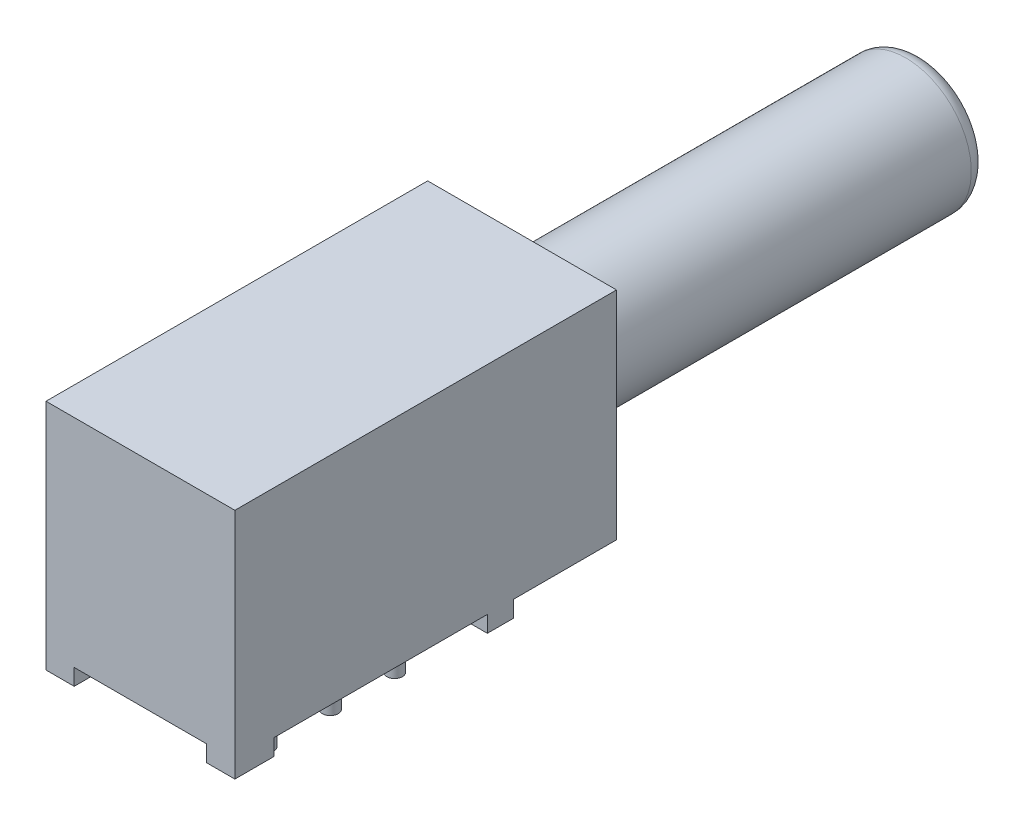
ISO-10303-21;
HEADER;
FILE_DESCRIPTION(('STEP AP214'),'2;1');
FILE_NAME('part.step','',(''),(''),'','','');
FILE_SCHEMA(('AUTOMOTIVE_DESIGN { 1 0 10303 214 1 1 1 1 }'));
ENDSEC;
DATA;
#1=APPLICATION_CONTEXT('core data for automotive mechanical design processes');
#2=APPLICATION_PROTOCOL_DEFINITION('international standard','automotive_design',2000,#1);
#3=PRODUCT_CONTEXT('',#1,'mechanical');
#4=PRODUCT('Part','Part','',(#3));
#5=PRODUCT_RELATED_PRODUCT_CATEGORY('part','',(#4));
#6=PRODUCT_DEFINITION_FORMATION('','',#4);
#7=PRODUCT_DEFINITION_CONTEXT('part definition',#1,'design');
#8=PRODUCT_DEFINITION('design','',#6,#7);
#9=PRODUCT_DEFINITION_SHAPE('','',#8);
#10=(LENGTH_UNIT() NAMED_UNIT(*) SI_UNIT(.MILLI.,.METRE.));
#11=(NAMED_UNIT(*) PLANE_ANGLE_UNIT() SI_UNIT($,.RADIAN.));
#12=(NAMED_UNIT(*) SI_UNIT($,.STERADIAN.) SOLID_ANGLE_UNIT());
#13=UNCERTAINTY_MEASURE_WITH_UNIT(LENGTH_MEASURE(1.E-05),#10,'distance_accuracy_value','');
#14=(GEOMETRIC_REPRESENTATION_CONTEXT(3) GLOBAL_UNCERTAINTY_ASSIGNED_CONTEXT((#13)) GLOBAL_UNIT_ASSIGNED_CONTEXT((#10,
#11,#12)) REPRESENTATION_CONTEXT('',''));
#15=CARTESIAN_POINT('',(0.,0.,0.));
#16=DIRECTION('',(0.,0.,1.));
#17=DIRECTION('',(1.,0.,0.));
#18=AXIS2_PLACEMENT_3D('',#15,#16,#17);
#19=CARTESIAN_POINT('',(4.9149,0.,-6.1976));
#20=DIRECTION('',(0.,0.,-1.));
#21=DIRECTION('',(-1.,0.,0.));
#22=AXIS2_PLACEMENT_3D('',#19,#20,#21);
#23=PLANE('',#22);
#24=DIRECTION('',(0.,-1.,0.));
#25=VECTOR('',#24,1.);
#26=CARTESIAN_POINT('',(4.9149,8.382,-6.1976));
#27=LINE('',#26,#25);
#28=CARTESIAN_POINT('',(4.9149,8.382,-6.1976));
#29=VERTEX_POINT('',#28);
#30=CARTESIAN_POINT('',(4.9149,0.,-6.1976));
#31=VERTEX_POINT('',#30);
#32=EDGE_CURVE('E175',#29,#31,#27,.T.);
#33=ORIENTED_EDGE('',*,*,#32,.T.);
#34=DIRECTION('',(-1.,0.,0.));
#35=VECTOR('',#34,1.);
#36=CARTESIAN_POINT('',(4.9149,0.,-6.1976));
#37=LINE('',#36,#35);
#38=CARTESIAN_POINT('',(-2.4003,0.,-6.1976));
#39=VERTEX_POINT('',#38);
#40=EDGE_CURVE('E162',#31,#39,#37,.T.);
#41=ORIENTED_EDGE('',*,*,#40,.T.);
#42=DIRECTION('',(0.,1.,0.));
#43=VECTOR('',#42,1.);
#44=CARTESIAN_POINT('',(-2.4003,8.382,-6.1976));
#45=LINE('',#44,#43);
#46=CARTESIAN_POINT('',(-2.4003,8.382,-6.1976));
#47=VERTEX_POINT('',#46);
#48=EDGE_CURVE('E174',#39,#47,#45,.T.);
#49=ORIENTED_EDGE('',*,*,#48,.T.);
#50=DIRECTION('',(1.,0.,0.));
#51=VECTOR('',#50,1.);
#52=CARTESIAN_POINT('',(4.9149,8.382,-6.1976));
#53=LINE('',#52,#51);
#54=EDGE_CURVE('E181',#47,#29,#53,.T.);
#55=ORIENTED_EDGE('',*,*,#54,.T.);
#56=EDGE_LOOP('',(#33,#41,#49,#55));
#57=FACE_BOUND('',#56,.T.);
#58=CARTESIAN_POINT('',(1.2573,4.3688,-6.1976));
#59=DIRECTION('',(0.,0.,-1.));
#60=DIRECTION('',(-1.,0.,0.));
#61=AXIS2_PLACEMENT_3D('',#58,#59,#60);
#62=CIRCLE('',#61,2.54);
#63=CARTESIAN_POINT('',(-1.2827,4.3688,-6.1976));
#64=VERTEX_POINT('',#63);
#65=EDGE_CURVE('E200',#64,#64,#62,.F.);
#66=ORIENTED_EDGE('',*,*,#65,.T.);
#67=EDGE_LOOP('',(#66));
#68=FACE_BOUND('',#67,.T.);
#69=ADVANCED_FACE('F36',(#57,#68),#23,.T.);
#70=CARTESIAN_POINT('',(-2.4003,8.382,-2.2098));
#71=DIRECTION('',(0.,0.,1.));
#72=DIRECTION('',(1.,0.,0.));
#73=AXIS2_PLACEMENT_3D('',#70,#71,#72);
#74=PLANE('',#73);
#75=DIRECTION('',(-1.,0.,0.));
#76=VECTOR('',#75,1.);
#77=CARTESIAN_POINT('',(4.9149,0.,-2.2098));
#78=LINE('',#77,#76);
#79=CARTESIAN_POINT('',(4.9149,0.,-2.2098));
#80=VERTEX_POINT('',#79);
#81=CARTESIAN_POINT('',(3.8227,0.,-2.2098));
#82=VERTEX_POINT('',#81);
#83=EDGE_CURVE('E51',#80,#82,#78,.T.);
#84=ORIENTED_EDGE('',*,*,#83,.F.);
#85=DIRECTION('',(0.,-1.,0.));
#86=VECTOR('',#85,1.);
#87=CARTESIAN_POINT('',(4.9149,8.382,-2.2098));
#88=LINE('',#87,#86);
#89=CARTESIAN_POINT('',(4.9149,-0.635,-2.2098));
#90=VERTEX_POINT('',#89);
#91=EDGE_CURVE('E187',#80,#90,#88,.T.);
#92=ORIENTED_EDGE('',*,*,#91,.T.);
#93=DIRECTION('',(1.,0.,0.));
#94=VECTOR('',#93,1.);
#95=CARTESIAN_POINT('',(1.2573,-0.635,-2.2098));
#96=LINE('',#95,#94);
#97=CARTESIAN_POINT('',(3.8227,-0.635,-2.2098));
#98=VERTEX_POINT('',#97);
#99=EDGE_CURVE('E245',#98,#90,#96,.T.);
#100=ORIENTED_EDGE('',*,*,#99,.F.);
#101=DIRECTION('',(0.,1.,0.));
#102=VECTOR('',#101,1.);
#103=CARTESIAN_POINT('',(3.8227,-0.635,-2.2098));
#104=LINE('',#103,#102);
#105=EDGE_CURVE('E254',#98,#82,#104,.T.);
#106=ORIENTED_EDGE('',*,*,#105,.T.);
#107=EDGE_LOOP('',(#84,#92,#100,#106));
#108=FACE_BOUND('',#107,.T.);
#109=ADVANCED_FACE('F371',(#108),#74,.F.);
#110=CARTESIAN_POINT('',(-1.3081,0.,-2.2098));
#111=VERTEX_POINT('',#110);
#112=CARTESIAN_POINT('',(-2.4003,0.,-2.2098));
#113=VERTEX_POINT('',#112);
#114=EDGE_CURVE('E203',#111,#113,#78,.T.);
#115=ORIENTED_EDGE('',*,*,#114,.F.);
#116=DIRECTION('',(0.,1.,0.));
#117=VECTOR('',#116,1.);
#118=CARTESIAN_POINT('',(-1.3081,-0.635,-2.2098));
#119=LINE('',#118,#117);
#120=CARTESIAN_POINT('',(-1.3081,-0.635,-2.2098));
#121=VERTEX_POINT('',#120);
#122=EDGE_CURVE('E233',#121,#111,#119,.T.);
#123=ORIENTED_EDGE('',*,*,#122,.F.);
#124=DIRECTION('',(1.,0.,0.));
#125=VECTOR('',#124,1.);
#126=CARTESIAN_POINT('',(1.2573,-0.635,-2.2098));
#127=LINE('',#126,#125);
#128=CARTESIAN_POINT('',(-2.4003,-0.635,-2.2098));
#129=VERTEX_POINT('',#128);
#130=EDGE_CURVE('E231',#129,#121,#127,.T.);
#131=ORIENTED_EDGE('',*,*,#130,.F.);
#132=DIRECTION('',(0.,-1.,0.));
#133=VECTOR('',#132,1.);
#134=CARTESIAN_POINT('',(-2.4003,8.382,-2.2098));
#135=LINE('',#134,#133);
#136=EDGE_CURVE('E213',#113,#129,#135,.T.);
#137=ORIENTED_EDGE('',*,*,#136,.F.);
#138=EDGE_LOOP('',(#115,#123,#131,#137));
#139=FACE_BOUND('',#138,.T.);
#140=ADVANCED_FACE('F367',(#139),#74,.F.);
#141=CARTESIAN_POINT('',(4.9149,0.,8.5852));
#142=DIRECTION('',(0.,1.,0.));
#143=DIRECTION('',(0.,0.,1.));
#144=AXIS2_PLACEMENT_3D('',#141,#142,#143);
#145=PLANE('',#144);
#146=CARTESIAN_POINT('',(2.5146,0.,4.9784));
#147=DIRECTION('',(0.,1.,0.));
#148=DIRECTION('',(0.,0.,1.));
#149=AXIS2_PLACEMENT_3D('',#146,#147,#148);
#150=CIRCLE('',#149,0.3048);
#151=CARTESIAN_POINT('',(2.5146,0.,5.2832));
#152=VERTEX_POINT('',#151);
#153=EDGE_CURVE('E302',#152,#152,#150,.T.);
#154=ORIENTED_EDGE('',*,*,#153,.T.);
#155=EDGE_LOOP('',(#154));
#156=FACE_BOUND('',#155,.T.);
#157=CARTESIAN_POINT('',(2.5146,0.,2.4892));
#158=DIRECTION('',(0.,1.,0.));
#159=DIRECTION('',(0.,0.,1.));
#160=AXIS2_PLACEMENT_3D('',#157,#158,#159);
#161=CIRCLE('',#160,0.3048);
#162=CARTESIAN_POINT('',(2.5146,0.,2.794));
#163=VERTEX_POINT('',#162);
#164=EDGE_CURVE('E306',#163,#163,#161,.T.);
#165=ORIENTED_EDGE('',*,*,#164,.T.);
#166=EDGE_LOOP('',(#165));
#167=FACE_BOUND('',#166,.T.);
#168=CARTESIAN_POINT('',(2.5146,0.,0.));
#169=DIRECTION('',(0.,1.,0.));
#170=DIRECTION('',(0.,0.,1.));
#171=AXIS2_PLACEMENT_3D('',#168,#169,#170);
#172=CIRCLE('',#171,0.3048);
#173=CARTESIAN_POINT('',(2.5146,0.,0.3048));
#174=VERTEX_POINT('',#173);
#175=EDGE_CURVE('E312',#174,#174,#172,.T.);
#176=ORIENTED_EDGE('',*,*,#175,.T.);
#177=EDGE_LOOP('',(#176));
#178=FACE_BOUND('',#177,.T.);
#179=CARTESIAN_POINT('',(0.,0.,4.9784));
#180=DIRECTION('',(0.,1.,0.));
#181=DIRECTION('',(0.,0.,1.));
#182=AXIS2_PLACEMENT_3D('',#179,#180,#181);
#183=CIRCLE('',#182,0.3048);
#184=CARTESIAN_POINT('',(0.,0.,5.2832));
#185=VERTEX_POINT('',#184);
#186=EDGE_CURVE('E318',#185,#185,#183,.T.);
#187=ORIENTED_EDGE('',*,*,#186,.T.);
#188=EDGE_LOOP('',(#187));
#189=FACE_BOUND('',#188,.T.);
#190=CARTESIAN_POINT('',(0.,0.,2.4892));
#191=DIRECTION('',(0.,1.,0.));
#192=DIRECTION('',(0.,0.,1.));
#193=AXIS2_PLACEMENT_3D('',#190,#191,#192);
#194=CIRCLE('',#193,0.3048);
#195=CARTESIAN_POINT('',(0.,0.,2.794));
#196=VERTEX_POINT('',#195);
#197=EDGE_CURVE('E324',#196,#196,#194,.T.);
#198=ORIENTED_EDGE('',*,*,#197,.T.);
#199=EDGE_LOOP('',(#198));
#200=FACE_BOUND('',#199,.T.);
#201=CARTESIAN_POINT('',(0.,0.,0.));
#202=DIRECTION('',(0.,1.,0.));
#203=DIRECTION('',(0.,0.,1.));
#204=AXIS2_PLACEMENT_3D('',#201,#202,#203);
#205=CIRCLE('',#204,0.3048);
#206=CARTESIAN_POINT('',(0.,0.,0.3048));
#207=VERTEX_POINT('',#206);
#208=EDGE_CURVE('E209',#207,#207,#205,.T.);
#209=ORIENTED_EDGE('',*,*,#208,.T.);
#210=EDGE_LOOP('',(#209));
#211=FACE_BOUND('',#210,.T.);
#212=DIRECTION('',(0.,0.,1.));
#213=VECTOR('',#212,1.);
#214=CARTESIAN_POINT('',(-1.3081,0.,-7.09653785384782));
#215=LINE('',#214,#213);
#216=CARTESIAN_POINT('',(-1.3081,0.,-1.1938));
#217=VERTEX_POINT('',#216);
#218=EDGE_CURVE('E188',#111,#217,#215,.T.);
#219=ORIENTED_EDGE('',*,*,#218,.F.);
#220=ORIENTED_EDGE('',*,*,#114,.T.);
#221=DIRECTION('',(0.,0.,1.));
#222=VECTOR('',#221,1.);
#223=CARTESIAN_POINT('',(-2.4003,0.,-6.1976));
#224=LINE('',#223,#222);
#225=EDGE_CURVE('E170',#39,#113,#224,.T.);
#226=ORIENTED_EDGE('',*,*,#225,.F.);
#227=ORIENTED_EDGE('',*,*,#40,.F.);
#228=DIRECTION('',(0.,0.,1.));
#229=VECTOR('',#228,1.);
#230=CARTESIAN_POINT('',(4.9149,0.,-6.1976));
#231=LINE('',#230,#229);
#232=EDGE_CURVE('E167',#31,#80,#231,.T.);
#233=ORIENTED_EDGE('',*,*,#232,.T.);
#234=ORIENTED_EDGE('',*,*,#83,.T.);
#235=DIRECTION('',(0.,0.,-1.));
#236=VECTOR('',#235,1.);
#237=CARTESIAN_POINT('',(3.8227,0.,-7.09653785384782));
#238=LINE('',#237,#236);
#239=CARTESIAN_POINT('',(3.8227,0.,-1.1938));
#240=VERTEX_POINT('',#239);
#241=EDGE_CURVE('E243',#240,#82,#238,.T.);
#242=ORIENTED_EDGE('',*,*,#241,.F.);
#243=DIRECTION('',(-1.,0.,0.));
#244=VECTOR('',#243,1.);
#245=CARTESIAN_POINT('',(1.2573,0.,-1.1938));
#246=LINE('',#245,#244);
#247=CARTESIAN_POINT('',(4.9149,0.,-1.1938));
#248=VERTEX_POINT('',#247);
#249=EDGE_CURVE('E238',#248,#240,#246,.T.);
#250=ORIENTED_EDGE('',*,*,#249,.F.);
#251=DIRECTION('',(0.,0.,-1.));
#252=VECTOR('',#251,1.);
#253=CARTESIAN_POINT('',(4.9149,0.,-2.2098));
#254=LINE('',#253,#252);
#255=CARTESIAN_POINT('',(4.9149,0.,7.0612));
#256=VERTEX_POINT('',#255);
#257=EDGE_CURVE('E330',#256,#248,#254,.T.);
#258=ORIENTED_EDGE('',*,*,#257,.F.);
#259=DIRECTION('',(1.,0.,0.));
#260=VECTOR('',#259,1.);
#261=CARTESIAN_POINT('',(1.25729999999999,0.,7.0612));
#262=LINE('',#261,#260);
#263=CARTESIAN_POINT('',(3.8227,0.,7.0612));
#264=VERTEX_POINT('',#263);
#265=EDGE_CURVE('E262',#264,#256,#262,.T.);
#266=ORIENTED_EDGE('',*,*,#265,.F.);
#267=DIRECTION('',(0.,0.,-1.));
#268=VECTOR('',#267,1.);
#269=CARTESIAN_POINT('',(3.82269999999999,0.,-7.09653785384782));
#270=LINE('',#269,#268);
#271=CARTESIAN_POINT('',(3.8227,0.,8.5852));
#272=VERTEX_POINT('',#271);
#273=EDGE_CURVE('E257',#272,#264,#270,.T.);
#274=ORIENTED_EDGE('',*,*,#273,.F.);
#275=DIRECTION('',(1.,0.,0.));
#276=VECTOR('',#275,1.);
#277=CARTESIAN_POINT('',(-2.4003,0.,8.5852));
#278=LINE('',#277,#276);
#279=CARTESIAN_POINT('',(-1.3081,0.,8.5852));
#280=VERTEX_POINT('',#279);
#281=EDGE_CURVE('E336',#280,#272,#278,.T.);
#282=ORIENTED_EDGE('',*,*,#281,.F.);
#283=DIRECTION('',(0.,0.,1.));
#284=VECTOR('',#283,1.);
#285=CARTESIAN_POINT('',(-1.3081,0.,-7.09653785384782));
#286=LINE('',#285,#284);
#287=CARTESIAN_POINT('',(-1.3081,0.,7.0612));
#288=VERTEX_POINT('',#287);
#289=EDGE_CURVE('E284',#288,#280,#286,.T.);
#290=ORIENTED_EDGE('',*,*,#289,.F.);
#291=DIRECTION('',(1.,0.,0.));
#292=VECTOR('',#291,1.);
#293=CARTESIAN_POINT('',(1.25730000000001,0.,7.0612));
#294=LINE('',#293,#292);
#295=CARTESIAN_POINT('',(-2.4003,0.,7.0612));
#296=VERTEX_POINT('',#295);
#297=EDGE_CURVE('E279',#296,#288,#294,.T.);
#298=ORIENTED_EDGE('',*,*,#297,.F.);
#299=DIRECTION('',(0.,0.,1.));
#300=VECTOR('',#299,1.);
#301=CARTESIAN_POINT('',(-2.4003,0.,-2.2098));
#302=LINE('',#301,#300);
#303=CARTESIAN_POINT('',(-2.4003,0.,-1.1938));
#304=VERTEX_POINT('',#303);
#305=EDGE_CURVE('E343',#304,#296,#302,.T.);
#306=ORIENTED_EDGE('',*,*,#305,.F.);
#307=DIRECTION('',(-1.,0.,0.));
#308=VECTOR('',#307,1.);
#309=CARTESIAN_POINT('',(1.2573,0.,-1.1938));
#310=LINE('',#309,#308);
#311=EDGE_CURVE('E191',#217,#304,#310,.T.);
#312=ORIENTED_EDGE('',*,*,#311,.F.);
#313=EDGE_LOOP('',(#219,#220,#226,#227,#233,#234,#242,#250,#258,#266,#274,#282,#290,#298,#306,#312));
#314=FACE_BOUND('',#313,.T.);
#315=ADVANCED_FACE('F165',(#156,#167,#178,#189,#200,#211,#314),#145,.F.);
#316=CARTESIAN_POINT('',(0.,-2.54,0.));
#317=DIRECTION('',(0.,1.,0.));
#318=DIRECTION('',(0.,0.,1.));
#319=AXIS2_PLACEMENT_3D('',#316,#317,#318);
#320=CYLINDRICAL_SURFACE('',#319,0.3048);
#321=CARTESIAN_POINT('',(0.,-2.54,0.));
#322=DIRECTION('',(0.,1.,0.));
#323=DIRECTION('',(0.,0.,1.));
#324=AXIS2_PLACEMENT_3D('',#321,#322,#323);
#325=CIRCLE('',#324,0.3048);
#326=CARTESIAN_POINT('',(0.,-2.54,0.3048));
#327=VERTEX_POINT('',#326);
#328=EDGE_CURVE('E206',#327,#327,#325,.T.);
#329=ORIENTED_EDGE('',*,*,#328,.T.);
#330=EDGE_LOOP('',(#329));
#331=FACE_BOUND('',#330,.T.);
#332=ORIENTED_EDGE('',*,*,#208,.F.);
#333=EDGE_LOOP('',(#332));
#334=FACE_BOUND('',#333,.T.);
#335=ADVANCED_FACE('F357',(#331,#334),#320,.T.);
#336=CARTESIAN_POINT('',(0.,-2.54,0.));
#337=DIRECTION('',(0.,1.,0.));
#338=DIRECTION('',(0.,0.,1.));
#339=AXIS2_PLACEMENT_3D('',#336,#337,#338);
#340=PLANE('',#339);
#341=ORIENTED_EDGE('',*,*,#328,.F.);
#342=EDGE_LOOP('',(#341));
#343=FACE_BOUND('',#342,.T.);
#344=ADVANCED_FACE('F359',(#343),#340,.F.);
#345=CARTESIAN_POINT('',(4.9149,8.382,-2.2098));
#346=DIRECTION('',(-1.,0.,0.));
#347=DIRECTION('',(0.,0.,1.));
#348=AXIS2_PLACEMENT_3D('',#345,#346,#347);
#349=PLANE('',#348);
#350=DIRECTION('',(0.,-1.,0.));
#351=VECTOR('',#350,1.);
#352=CARTESIAN_POINT('',(4.9149,8.382,8.5852));
#353=LINE('',#352,#351);
#354=CARTESIAN_POINT('',(4.9149,8.382,8.5852));
#355=VERTEX_POINT('',#354);
#356=CARTESIAN_POINT('',(4.9149,-0.635,8.5852));
#357=VERTEX_POINT('',#356);
#358=EDGE_CURVE('E340',#355,#357,#353,.T.);
#359=ORIENTED_EDGE('',*,*,#358,.T.);
#360=DIRECTION('',(0.,0.,1.));
#361=VECTOR('',#360,1.);
#362=CARTESIAN_POINT('',(4.9149,-0.635,-7.09653785384782));
#363=LINE('',#362,#361);
#364=CARTESIAN_POINT('',(4.9149,-0.635,7.0612));
#365=VERTEX_POINT('',#364);
#366=EDGE_CURVE('E264',#365,#357,#363,.T.);
#367=ORIENTED_EDGE('',*,*,#366,.F.);
#368=DIRECTION('',(0.,1.,0.));
#369=VECTOR('',#368,1.);
#370=CARTESIAN_POINT('',(4.9149,-0.635,7.0612));
#371=LINE('',#370,#369);
#372=EDGE_CURVE('E274',#365,#256,#371,.T.);
#373=ORIENTED_EDGE('',*,*,#372,.T.);
#374=ORIENTED_EDGE('',*,*,#257,.T.);
#375=DIRECTION('',(0.,1.,0.));
#376=VECTOR('',#375,1.);
#377=CARTESIAN_POINT('',(4.9149,-0.635,-1.1938));
#378=LINE('',#377,#376);
#379=CARTESIAN_POINT('',(4.9149,-0.635,-1.1938));
#380=VERTEX_POINT('',#379);
#381=EDGE_CURVE('E250',#380,#248,#378,.T.);
#382=ORIENTED_EDGE('',*,*,#381,.F.);
#383=DIRECTION('',(0.,0.,1.));
#384=VECTOR('',#383,1.);
#385=CARTESIAN_POINT('',(4.9149,-0.635,-7.09653785384782));
#386=LINE('',#385,#384);
#387=EDGE_CURVE('E248',#90,#380,#386,.T.);
#388=ORIENTED_EDGE('',*,*,#387,.F.);
#389=ORIENTED_EDGE('',*,*,#91,.F.);
#390=ORIENTED_EDGE('',*,*,#232,.F.);
#391=ORIENTED_EDGE('',*,*,#32,.F.);
#392=DIRECTION('',(0.,0.,-1.));
#393=VECTOR('',#392,1.);
#394=CARTESIAN_POINT('',(4.9149,8.382,-2.2098));
#395=LINE('',#394,#393);
#396=EDGE_CURVE('E333',#355,#29,#395,.T.);
#397=ORIENTED_EDGE('',*,*,#396,.F.);
#398=EDGE_LOOP('',(#359,#367,#373,#374,#382,#388,#389,#390,#391,#397));
#399=FACE_BOUND('',#398,.T.);
#400=ADVANCED_FACE('F185',(#399),#349,.F.);
#401=CARTESIAN_POINT('',(-2.4003,8.382,-2.2098));
#402=DIRECTION('',(1.,0.,0.));
#403=DIRECTION('',(0.,0.,-1.));
#404=AXIS2_PLACEMENT_3D('',#401,#402,#403);
#405=PLANE('',#404);
#406=DIRECTION('',(0.,0.,1.));
#407=VECTOR('',#406,1.);
#408=CARTESIAN_POINT('',(-2.4003,8.382,-2.2098));
#409=LINE('',#408,#407);
#410=CARTESIAN_POINT('',(-2.4003,8.382,8.5852));
#411=VERTEX_POINT('',#410);
#412=EDGE_CURVE('E335',#47,#411,#409,.T.);
#413=ORIENTED_EDGE('',*,*,#412,.F.);
#414=ORIENTED_EDGE('',*,*,#48,.F.);
#415=ORIENTED_EDGE('',*,*,#225,.T.);
#416=ORIENTED_EDGE('',*,*,#136,.T.);
#417=DIRECTION('',(0.,0.,-1.));
#418=VECTOR('',#417,1.);
#419=CARTESIAN_POINT('',(-2.4003,-0.635,-7.09653785384782));
#420=LINE('',#419,#418);
#421=CARTESIAN_POINT('',(-2.4003,-0.635,-1.1938));
#422=VERTEX_POINT('',#421);
#423=EDGE_CURVE('E228',#422,#129,#420,.T.);
#424=ORIENTED_EDGE('',*,*,#423,.F.);
#425=DIRECTION('',(0.,1.,0.));
#426=VECTOR('',#425,1.);
#427=CARTESIAN_POINT('',(-2.4003,-0.635,-1.1938));
#428=LINE('',#427,#426);
#429=EDGE_CURVE('E59',#422,#304,#428,.T.);
#430=ORIENTED_EDGE('',*,*,#429,.T.);
#431=ORIENTED_EDGE('',*,*,#305,.T.);
#432=DIRECTION('',(0.,1.,0.));
#433=VECTOR('',#432,1.);
#434=CARTESIAN_POINT('',(-2.4003,-0.635,7.0612));
#435=LINE('',#434,#433);
#436=CARTESIAN_POINT('',(-2.4003,-0.635,7.0612));
#437=VERTEX_POINT('',#436);
#438=EDGE_CURVE('E291',#437,#296,#435,.T.);
#439=ORIENTED_EDGE('',*,*,#438,.F.);
#440=DIRECTION('',(0.,0.,-1.));
#441=VECTOR('',#440,1.);
#442=CARTESIAN_POINT('',(-2.4003,-0.635,-7.09653785384782));
#443=LINE('',#442,#441);
#444=CARTESIAN_POINT('',(-2.4003,-0.635,8.5852));
#445=VERTEX_POINT('',#444);
#446=EDGE_CURVE('E289',#445,#437,#443,.T.);
#447=ORIENTED_EDGE('',*,*,#446,.F.);
#448=DIRECTION('',(0.,-1.,0.));
#449=VECTOR('',#448,1.);
#450=CARTESIAN_POINT('',(-2.4003,8.382,8.5852));
#451=LINE('',#450,#449);
#452=EDGE_CURVE('E348',#411,#445,#451,.T.);
#453=ORIENTED_EDGE('',*,*,#452,.F.);
#454=EDGE_LOOP('',(#413,#414,#415,#416,#424,#430,#431,#439,#447,#453));
#455=FACE_BOUND('',#454,.T.);
#456=ADVANCED_FACE('F476',(#455),#405,.F.);
#457=CARTESIAN_POINT('',(-2.4003,8.382,8.5852));
#458=DIRECTION('',(0.,0.,-1.));
#459=DIRECTION('',(-1.,0.,0.));
#460=AXIS2_PLACEMENT_3D('',#457,#458,#459);
#461=PLANE('',#460);
#462=ORIENTED_EDGE('',*,*,#452,.T.);
#463=DIRECTION('',(-1.,0.,0.));
#464=VECTOR('',#463,1.);
#465=CARTESIAN_POINT('',(1.2573,-0.635,8.5852));
#466=LINE('',#465,#464);
#467=CARTESIAN_POINT('',(-1.3081,-0.635,8.5852));
#468=VERTEX_POINT('',#467);
#469=EDGE_CURVE('E286',#468,#445,#466,.T.);
#470=ORIENTED_EDGE('',*,*,#469,.F.);
#471=DIRECTION('',(0.,1.,0.));
#472=VECTOR('',#471,1.);
#473=CARTESIAN_POINT('',(-1.3081,-0.635,8.5852));
#474=LINE('',#473,#472);
#475=EDGE_CURVE('E297',#468,#280,#474,.T.);
#476=ORIENTED_EDGE('',*,*,#475,.T.);
#477=ORIENTED_EDGE('',*,*,#281,.T.);
#478=DIRECTION('',(0.,1.,0.));
#479=VECTOR('',#478,1.);
#480=CARTESIAN_POINT('',(3.8227,-0.635,8.5852));
#481=LINE('',#480,#479);
#482=CARTESIAN_POINT('',(3.8227,-0.635,8.5852));
#483=VERTEX_POINT('',#482);
#484=EDGE_CURVE('E269',#483,#272,#481,.T.);
#485=ORIENTED_EDGE('',*,*,#484,.F.);
#486=DIRECTION('',(-1.,0.,0.));
#487=VECTOR('',#486,1.);
#488=CARTESIAN_POINT('',(1.2573,-0.635,8.5852));
#489=LINE('',#488,#487);
#490=EDGE_CURVE('E267',#357,#483,#489,.T.);
#491=ORIENTED_EDGE('',*,*,#490,.F.);
#492=ORIENTED_EDGE('',*,*,#358,.F.);
#493=DIRECTION('',(1.,0.,0.));
#494=VECTOR('',#493,1.);
#495=CARTESIAN_POINT('',(-2.4003,8.382,8.5852));
#496=LINE('',#495,#494);
#497=EDGE_CURVE('E338',#411,#355,#496,.T.);
#498=ORIENTED_EDGE('',*,*,#497,.F.);
#499=EDGE_LOOP('',(#462,#470,#476,#477,#485,#491,#492,#498));
#500=FACE_BOUND('',#499,.T.);
#501=ADVANCED_FACE('F471',(#500),#461,.F.);
#502=CARTESIAN_POINT('',(4.9149,8.382,8.5852));
#503=DIRECTION('',(0.,1.,0.));
#504=DIRECTION('',(0.,0.,1.));
#505=AXIS2_PLACEMENT_3D('',#502,#503,#504);
#506=PLANE('',#505);
#507=ORIENTED_EDGE('',*,*,#396,.T.);
#508=ORIENTED_EDGE('',*,*,#54,.F.);
#509=ORIENTED_EDGE('',*,*,#412,.T.);
#510=ORIENTED_EDGE('',*,*,#497,.T.);
#511=EDGE_LOOP('',(#507,#508,#509,#510));
#512=FACE_BOUND('',#511,.T.);
#513=ADVANCED_FACE('F468',(#512),#506,.T.);
#514=CARTESIAN_POINT('',(0.,-2.54,2.4892));
#515=DIRECTION('',(0.,1.,0.));
#516=DIRECTION('',(0.,0.,1.));
#517=AXIS2_PLACEMENT_3D('',#514,#515,#516);
#518=CYLINDRICAL_SURFACE('',#517,0.3048);
#519=CARTESIAN_POINT('',(0.,-2.54,2.4892));
#520=DIRECTION('',(0.,1.,0.));
#521=DIRECTION('',(0.,0.,1.));
#522=AXIS2_PLACEMENT_3D('',#519,#520,#521);
#523=CIRCLE('',#522,0.3048);
#524=CARTESIAN_POINT('',(0.,-2.54,2.794));
#525=VERTEX_POINT('',#524);
#526=EDGE_CURVE('E327',#525,#525,#523,.T.);
#527=ORIENTED_EDGE('',*,*,#526,.T.);
#528=EDGE_LOOP('',(#527));
#529=FACE_BOUND('',#528,.T.);
#530=ORIENTED_EDGE('',*,*,#197,.F.);
#531=EDGE_LOOP('',(#530));
#532=FACE_BOUND('',#531,.T.);
#533=ADVANCED_FACE('F464',(#529,#532),#518,.T.);
#534=CARTESIAN_POINT('',(0.,-2.54,2.4892));
#535=DIRECTION('',(0.,1.,0.));
#536=DIRECTION('',(0.,0.,1.));
#537=AXIS2_PLACEMENT_3D('',#534,#535,#536);
#538=PLANE('',#537);
#539=ORIENTED_EDGE('',*,*,#526,.F.);
#540=EDGE_LOOP('',(#539));
#541=FACE_BOUND('',#540,.T.);
#542=ADVANCED_FACE('F460',(#541),#538,.F.);
#543=CARTESIAN_POINT('',(0.,-2.54,4.9784));
#544=DIRECTION('',(0.,1.,0.));
#545=DIRECTION('',(0.,0.,1.));
#546=AXIS2_PLACEMENT_3D('',#543,#544,#545);
#547=CYLINDRICAL_SURFACE('',#546,0.3048);
#548=CARTESIAN_POINT('',(0.,-2.54,4.9784));
#549=DIRECTION('',(0.,1.,0.));
#550=DIRECTION('',(0.,0.,1.));
#551=AXIS2_PLACEMENT_3D('',#548,#549,#550);
#552=CIRCLE('',#551,0.3048);
#553=CARTESIAN_POINT('',(0.,-2.54,5.2832));
#554=VERTEX_POINT('',#553);
#555=EDGE_CURVE('E321',#554,#554,#552,.T.);
#556=ORIENTED_EDGE('',*,*,#555,.T.);
#557=EDGE_LOOP('',(#556));
#558=FACE_BOUND('',#557,.T.);
#559=ORIENTED_EDGE('',*,*,#186,.F.);
#560=EDGE_LOOP('',(#559));
#561=FACE_BOUND('',#560,.T.);
#562=ADVANCED_FACE('F456',(#558,#561),#547,.T.);
#563=CARTESIAN_POINT('',(0.,-2.54,4.9784));
#564=DIRECTION('',(0.,1.,0.));
#565=DIRECTION('',(0.,0.,1.));
#566=AXIS2_PLACEMENT_3D('',#563,#564,#565);
#567=PLANE('',#566);
#568=ORIENTED_EDGE('',*,*,#555,.F.);
#569=EDGE_LOOP('',(#568));
#570=FACE_BOUND('',#569,.T.);
#571=ADVANCED_FACE('F452',(#570),#567,.F.);
#572=CARTESIAN_POINT('',(2.5146,-2.54,0.));
#573=DIRECTION('',(0.,1.,0.));
#574=DIRECTION('',(0.,0.,1.));
#575=AXIS2_PLACEMENT_3D('',#572,#573,#574);
#576=CYLINDRICAL_SURFACE('',#575,0.3048);
#577=CARTESIAN_POINT('',(2.5146,-2.54,0.));
#578=DIRECTION('',(0.,1.,0.));
#579=DIRECTION('',(0.,0.,1.));
#580=AXIS2_PLACEMENT_3D('',#577,#578,#579);
#581=CIRCLE('',#580,0.3048);
#582=CARTESIAN_POINT('',(2.5146,-2.54,0.3048));
#583=VERTEX_POINT('',#582);
#584=EDGE_CURVE('E315',#583,#583,#581,.T.);
#585=ORIENTED_EDGE('',*,*,#584,.T.);
#586=EDGE_LOOP('',(#585));
#587=FACE_BOUND('',#586,.T.);
#588=ORIENTED_EDGE('',*,*,#175,.F.);
#589=EDGE_LOOP('',(#588));
#590=FACE_BOUND('',#589,.T.);
#591=ADVANCED_FACE('F448',(#587,#590),#576,.T.);
#592=CARTESIAN_POINT('',(2.5146,-2.54,0.));
#593=DIRECTION('',(0.,1.,0.));
#594=DIRECTION('',(0.,0.,1.));
#595=AXIS2_PLACEMENT_3D('',#592,#593,#594);
#596=PLANE('',#595);
#597=ORIENTED_EDGE('',*,*,#584,.F.);
#598=EDGE_LOOP('',(#597));
#599=FACE_BOUND('',#598,.T.);
#600=ADVANCED_FACE('F444',(#599),#596,.F.);
#601=CARTESIAN_POINT('',(2.5146,-2.54,2.4892));
#602=DIRECTION('',(0.,1.,0.));
#603=DIRECTION('',(0.,0.,1.));
#604=AXIS2_PLACEMENT_3D('',#601,#602,#603);
#605=CYLINDRICAL_SURFACE('',#604,0.3048);
#606=CARTESIAN_POINT('',(2.5146,-2.54,2.4892));
#607=DIRECTION('',(0.,1.,0.));
#608=DIRECTION('',(0.,0.,1.));
#609=AXIS2_PLACEMENT_3D('',#606,#607,#608);
#610=CIRCLE('',#609,0.3048);
#611=CARTESIAN_POINT('',(2.5146,-2.54,2.794));
#612=VERTEX_POINT('',#611);
#613=EDGE_CURVE('E309',#612,#612,#610,.T.);
#614=ORIENTED_EDGE('',*,*,#613,.T.);
#615=EDGE_LOOP('',(#614));
#616=FACE_BOUND('',#615,.T.);
#617=ORIENTED_EDGE('',*,*,#164,.F.);
#618=EDGE_LOOP('',(#617));
#619=FACE_BOUND('',#618,.T.);
#620=ADVANCED_FACE('F440',(#616,#619),#605,.T.);
#621=CARTESIAN_POINT('',(2.5146,-2.54,2.4892));
#622=DIRECTION('',(0.,1.,0.));
#623=DIRECTION('',(0.,0.,1.));
#624=AXIS2_PLACEMENT_3D('',#621,#622,#623);
#625=PLANE('',#624);
#626=ORIENTED_EDGE('',*,*,#613,.F.);
#627=EDGE_LOOP('',(#626));
#628=FACE_BOUND('',#627,.T.);
#629=ADVANCED_FACE('F436',(#628),#625,.F.);
#630=CARTESIAN_POINT('',(2.5146,-2.54,4.9784));
#631=DIRECTION('',(0.,1.,0.));
#632=DIRECTION('',(0.,0.,1.));
#633=AXIS2_PLACEMENT_3D('',#630,#631,#632);
#634=CYLINDRICAL_SURFACE('',#633,0.3048);
#635=CARTESIAN_POINT('',(2.5146,-2.54,4.9784));
#636=DIRECTION('',(0.,1.,0.));
#637=DIRECTION('',(0.,0.,1.));
#638=AXIS2_PLACEMENT_3D('',#635,#636,#637);
#639=CIRCLE('',#638,0.3048);
#640=CARTESIAN_POINT('',(2.5146,-2.54,5.2832));
#641=VERTEX_POINT('',#640);
#642=EDGE_CURVE('E303',#641,#641,#639,.T.);
#643=ORIENTED_EDGE('',*,*,#642,.T.);
#644=EDGE_LOOP('',(#643));
#645=FACE_BOUND('',#644,.T.);
#646=ORIENTED_EDGE('',*,*,#153,.F.);
#647=EDGE_LOOP('',(#646));
#648=FACE_BOUND('',#647,.T.);
#649=ADVANCED_FACE('F432',(#645,#648),#634,.T.);
#650=CARTESIAN_POINT('',(2.5146,-2.54,4.9784));
#651=DIRECTION('',(0.,1.,0.));
#652=DIRECTION('',(0.,0.,1.));
#653=AXIS2_PLACEMENT_3D('',#650,#651,#652);
#654=PLANE('',#653);
#655=ORIENTED_EDGE('',*,*,#642,.F.);
#656=EDGE_LOOP('',(#655));
#657=FACE_BOUND('',#656,.T.);
#658=ADVANCED_FACE('F428',(#657),#654,.F.);
#659=CARTESIAN_POINT('',(1.25730000000001,-0.635,7.0612));
#660=DIRECTION('',(0.,0.,1.));
#661=DIRECTION('',(1.,0.,0.));
#662=AXIS2_PLACEMENT_3D('',#659,#660,#661);
#663=PLANE('',#662);
#664=ORIENTED_EDGE('',*,*,#297,.T.);
#665=DIRECTION('',(0.,1.,0.));
#666=VECTOR('',#665,1.);
#667=CARTESIAN_POINT('',(-1.3081,-0.635,7.0612));
#668=LINE('',#667,#666);
#669=CARTESIAN_POINT('',(-1.3081,-0.635,7.0612));
#670=VERTEX_POINT('',#669);
#671=EDGE_CURVE('E300',#670,#288,#668,.T.);
#672=ORIENTED_EDGE('',*,*,#671,.F.);
#673=DIRECTION('',(1.,0.,0.));
#674=VECTOR('',#673,1.);
#675=CARTESIAN_POINT('',(1.25730000000001,-0.635,7.0612));
#676=LINE('',#675,#674);
#677=EDGE_CURVE('E280',#437,#670,#676,.T.);
#678=ORIENTED_EDGE('',*,*,#677,.F.);
#679=ORIENTED_EDGE('',*,*,#438,.T.);
#680=EDGE_LOOP('',(#664,#672,#678,#679));
#681=FACE_BOUND('',#680,.T.);
#682=ADVANCED_FACE('F424',(#681),#663,.F.);
#683=CARTESIAN_POINT('',(-1.3081,-0.635,-7.09653785384782));
#684=DIRECTION('',(-1.,0.,0.));
#685=DIRECTION('',(0.,0.,1.));
#686=AXIS2_PLACEMENT_3D('',#683,#684,#685);
#687=PLANE('',#686);
#688=ORIENTED_EDGE('',*,*,#289,.T.);
#689=ORIENTED_EDGE('',*,*,#475,.F.);
#690=DIRECTION('',(0.,0.,1.));
#691=VECTOR('',#690,1.);
#692=CARTESIAN_POINT('',(-1.3081,-0.635,-7.09653785384782));
#693=LINE('',#692,#691);
#694=EDGE_CURVE('E283',#670,#468,#693,.T.);
#695=ORIENTED_EDGE('',*,*,#694,.F.);
#696=ORIENTED_EDGE('',*,*,#671,.T.);
#697=EDGE_LOOP('',(#688,#689,#695,#696));
#698=FACE_BOUND('',#697,.T.);
#699=ADVANCED_FACE('F420',(#698),#687,.F.);
#700=CARTESIAN_POINT('',(1.2573,-0.635,-7.09653785384782));
#701=DIRECTION('',(0.,-1.,0.));
#702=DIRECTION('',(0.,0.,-1.));
#703=AXIS2_PLACEMENT_3D('',#700,#701,#702);
#704=PLANE('',#703);
#705=ORIENTED_EDGE('',*,*,#677,.T.);
#706=ORIENTED_EDGE('',*,*,#694,.T.);
#707=ORIENTED_EDGE('',*,*,#469,.T.);
#708=ORIENTED_EDGE('',*,*,#446,.T.);
#709=EDGE_LOOP('',(#705,#706,#707,#708));
#710=FACE_BOUND('',#709,.T.);
#711=ADVANCED_FACE('F416',(#710),#704,.T.);
#712=CARTESIAN_POINT('',(3.82269999999999,-0.635,-7.09653785384782));
#713=DIRECTION('',(1.,0.,0.));
#714=DIRECTION('',(0.,0.,-1.));
#715=AXIS2_PLACEMENT_3D('',#712,#713,#714);
#716=PLANE('',#715);
#717=ORIENTED_EDGE('',*,*,#273,.T.);
#718=DIRECTION('',(0.,1.,0.));
#719=VECTOR('',#718,1.);
#720=CARTESIAN_POINT('',(3.8227,-0.635,7.0612));
#721=LINE('',#720,#719);
#722=CARTESIAN_POINT('',(3.8227,-0.635,7.0612));
#723=VERTEX_POINT('',#722);
#724=EDGE_CURVE('E277',#723,#264,#721,.T.);
#725=ORIENTED_EDGE('',*,*,#724,.F.);
#726=DIRECTION('',(0.,0.,-1.));
#727=VECTOR('',#726,1.);
#728=CARTESIAN_POINT('',(3.82269999999999,-0.635,-7.09653785384782));
#729=LINE('',#728,#727);
#730=EDGE_CURVE('E258',#483,#723,#729,.T.);
#731=ORIENTED_EDGE('',*,*,#730,.F.);
#732=ORIENTED_EDGE('',*,*,#484,.T.);
#733=EDGE_LOOP('',(#717,#725,#731,#732));
#734=FACE_BOUND('',#733,.T.);
#735=ADVANCED_FACE('F412',(#734),#716,.F.);
#736=CARTESIAN_POINT('',(1.25729999999999,-0.635,7.0612));
#737=DIRECTION('',(0.,0.,1.));
#738=DIRECTION('',(1.,0.,0.));
#739=AXIS2_PLACEMENT_3D('',#736,#737,#738);
#740=PLANE('',#739);
#741=ORIENTED_EDGE('',*,*,#265,.T.);
#742=ORIENTED_EDGE('',*,*,#372,.F.);
#743=DIRECTION('',(1.,0.,0.));
#744=VECTOR('',#743,1.);
#745=CARTESIAN_POINT('',(1.25729999999999,-0.635,7.0612));
#746=LINE('',#745,#744);
#747=EDGE_CURVE('E261',#723,#365,#746,.T.);
#748=ORIENTED_EDGE('',*,*,#747,.F.);
#749=ORIENTED_EDGE('',*,*,#724,.T.);
#750=EDGE_LOOP('',(#741,#742,#748,#749));
#751=FACE_BOUND('',#750,.T.);
#752=ADVANCED_FACE('F408',(#751),#740,.F.);
#753=CARTESIAN_POINT('',(1.2573,-0.635,-7.09653785384782));
#754=DIRECTION('',(0.,-1.,0.));
#755=DIRECTION('',(0.,0.,-1.));
#756=AXIS2_PLACEMENT_3D('',#753,#754,#755);
#757=PLANE('',#756);
#758=ORIENTED_EDGE('',*,*,#730,.T.);
#759=ORIENTED_EDGE('',*,*,#747,.T.);
#760=ORIENTED_EDGE('',*,*,#366,.T.);
#761=ORIENTED_EDGE('',*,*,#490,.T.);
#762=EDGE_LOOP('',(#758,#759,#760,#761));
#763=FACE_BOUND('',#762,.T.);
#764=ADVANCED_FACE('F404',(#763),#757,.T.);
#765=CARTESIAN_POINT('',(1.2573,-0.635,-1.1938));
#766=DIRECTION('',(0.,0.,-1.));
#767=DIRECTION('',(-1.,0.,0.));
#768=AXIS2_PLACEMENT_3D('',#765,#766,#767);
#769=PLANE('',#768);
#770=ORIENTED_EDGE('',*,*,#249,.T.);
#771=DIRECTION('',(0.,1.,0.));
#772=VECTOR('',#771,1.);
#773=CARTESIAN_POINT('',(3.8227,-0.635,-1.1938));
#774=LINE('',#773,#772);
#775=CARTESIAN_POINT('',(3.8227,-0.635,-1.1938));
#776=VERTEX_POINT('',#775);
#777=EDGE_CURVE('E255',#776,#240,#774,.T.);
#778=ORIENTED_EDGE('',*,*,#777,.F.);
#779=DIRECTION('',(-1.,0.,0.));
#780=VECTOR('',#779,1.);
#781=CARTESIAN_POINT('',(1.2573,-0.635,-1.1938));
#782=LINE('',#781,#780);
#783=EDGE_CURVE('E239',#380,#776,#782,.T.);
#784=ORIENTED_EDGE('',*,*,#783,.F.);
#785=ORIENTED_EDGE('',*,*,#381,.T.);
#786=EDGE_LOOP('',(#770,#778,#784,#785));
#787=FACE_BOUND('',#786,.T.);
#788=ADVANCED_FACE('F400',(#787),#769,.F.);
#789=CARTESIAN_POINT('',(3.8227,-0.635,-7.09653785384782));
#790=DIRECTION('',(1.,0.,0.));
#791=DIRECTION('',(0.,0.,-1.));
#792=AXIS2_PLACEMENT_3D('',#789,#790,#791);
#793=PLANE('',#792);
#794=ORIENTED_EDGE('',*,*,#241,.T.);
#795=ORIENTED_EDGE('',*,*,#105,.F.);
#796=DIRECTION('',(0.,0.,-1.));
#797=VECTOR('',#796,1.);
#798=CARTESIAN_POINT('',(3.8227,-0.635,-7.09653785384782));
#799=LINE('',#798,#797);
#800=EDGE_CURVE('E242',#776,#98,#799,.T.);
#801=ORIENTED_EDGE('',*,*,#800,.F.);
#802=ORIENTED_EDGE('',*,*,#777,.T.);
#803=EDGE_LOOP('',(#794,#795,#801,#802));
#804=FACE_BOUND('',#803,.T.);
#805=ADVANCED_FACE('F396',(#804),#793,.F.);
#806=CARTESIAN_POINT('',(1.2573,-0.635,-7.09653785384782));
#807=DIRECTION('',(0.,-1.,0.));
#808=DIRECTION('',(0.,0.,-1.));
#809=AXIS2_PLACEMENT_3D('',#806,#807,#808);
#810=PLANE('',#809);
#811=ORIENTED_EDGE('',*,*,#783,.T.);
#812=ORIENTED_EDGE('',*,*,#800,.T.);
#813=ORIENTED_EDGE('',*,*,#99,.T.);
#814=ORIENTED_EDGE('',*,*,#387,.T.);
#815=EDGE_LOOP('',(#811,#812,#813,#814));
#816=FACE_BOUND('',#815,.T.);
#817=ADVANCED_FACE('F392',(#816),#810,.T.);
#818=CARTESIAN_POINT('',(-1.3081,-0.635,-7.09653785384782));
#819=DIRECTION('',(-1.,0.,0.));
#820=DIRECTION('',(0.,0.,1.));
#821=AXIS2_PLACEMENT_3D('',#818,#819,#820);
#822=PLANE('',#821);
#823=ORIENTED_EDGE('',*,*,#218,.T.);
#824=DIRECTION('',(0.,1.,0.));
#825=VECTOR('',#824,1.);
#826=CARTESIAN_POINT('',(-1.3081,-0.635,-1.1938));
#827=LINE('',#826,#825);
#828=CARTESIAN_POINT('',(-1.3081,-0.635,-1.1938));
#829=VERTEX_POINT('',#828);
#830=EDGE_CURVE('E236',#829,#217,#827,.T.);
#831=ORIENTED_EDGE('',*,*,#830,.F.);
#832=DIRECTION('',(0.,0.,1.));
#833=VECTOR('',#832,1.);
#834=CARTESIAN_POINT('',(-1.3081,-0.635,-7.09653785384782));
#835=LINE('',#834,#833);
#836=EDGE_CURVE('E223',#121,#829,#835,.T.);
#837=ORIENTED_EDGE('',*,*,#836,.F.);
#838=ORIENTED_EDGE('',*,*,#122,.T.);
#839=EDGE_LOOP('',(#823,#831,#837,#838));
#840=FACE_BOUND('',#839,.T.);
#841=ADVANCED_FACE('F388',(#840),#822,.F.);
#842=CARTESIAN_POINT('',(1.2573,-0.635,-1.1938));
#843=DIRECTION('',(0.,0.,-1.));
#844=DIRECTION('',(-1.,0.,0.));
#845=AXIS2_PLACEMENT_3D('',#842,#843,#844);
#846=PLANE('',#845);
#847=ORIENTED_EDGE('',*,*,#311,.T.);
#848=ORIENTED_EDGE('',*,*,#429,.F.);
#849=DIRECTION('',(-1.,0.,0.));
#850=VECTOR('',#849,1.);
#851=CARTESIAN_POINT('',(1.2573,-0.635,-1.1938));
#852=LINE('',#851,#850);
#853=EDGE_CURVE('E226',#829,#422,#852,.T.);
#854=ORIENTED_EDGE('',*,*,#853,.F.);
#855=ORIENTED_EDGE('',*,*,#830,.T.);
#856=EDGE_LOOP('',(#847,#848,#854,#855));
#857=FACE_BOUND('',#856,.T.);
#858=ADVANCED_FACE('F384',(#857),#846,.F.);
#859=CARTESIAN_POINT('',(1.2573,-0.635,-7.09653785384782));
#860=DIRECTION('',(0.,-1.,0.));
#861=DIRECTION('',(0.,0.,-1.));
#862=AXIS2_PLACEMENT_3D('',#859,#860,#861);
#863=PLANE('',#862);
#864=ORIENTED_EDGE('',*,*,#836,.T.);
#865=ORIENTED_EDGE('',*,*,#853,.T.);
#866=ORIENTED_EDGE('',*,*,#423,.T.);
#867=ORIENTED_EDGE('',*,*,#130,.T.);
#868=EDGE_LOOP('',(#864,#865,#866,#867));
#869=FACE_BOUND('',#868,.T.);
#870=ADVANCED_FACE('F381',(#869),#863,.T.);
#871=CARTESIAN_POINT('',(1.2573,4.3688,-21.6916));
#872=DIRECTION('',(0.,0.,1.));
#873=DIRECTION('',(1.,0.,0.));
#874=AXIS2_PLACEMENT_3D('',#871,#872,#873);
#875=CYLINDRICAL_SURFACE('',#874,2.54);
#876=CARTESIAN_POINT('',(1.2573,4.3688,-21.0566));
#877=DIRECTION('',(0.,0.,-1.));
#878=DIRECTION('',(-1.,0.,0.));
#879=AXIS2_PLACEMENT_3D('',#876,#877,#878);
#880=CIRCLE('',#879,2.54);
#881=CARTESIAN_POINT('',(-1.2827,4.3688,-21.0566));
#882=VERTEX_POINT('',#881);
#883=EDGE_CURVE('E11',#882,#882,#880,.F.);
#884=ORIENTED_EDGE('',*,*,#883,.T.);
#885=EDGE_LOOP('',(#884));
#886=FACE_BOUND('',#885,.T.);
#887=ORIENTED_EDGE('',*,*,#65,.F.);
#888=EDGE_LOOP('',(#887));
#889=FACE_BOUND('',#888,.T.);
#890=ADVANCED_FACE('F379',(#886,#889),#875,.T.);
#891=CARTESIAN_POINT('',(1.2573,4.3688,-21.6916));
#892=DIRECTION('',(0.,0.,-1.));
#893=DIRECTION('',(-1.,0.,0.));
#894=AXIS2_PLACEMENT_3D('',#891,#892,#893);
#895=PLANE('',#894);
#896=CARTESIAN_POINT('',(1.2573,4.3688,-21.6916));
#897=DIRECTION('',(0.,0.,-1.));
#898=DIRECTION('',(-1.,0.,0.));
#899=AXIS2_PLACEMENT_3D('',#896,#897,#898);
#900=CIRCLE('',#899,1.905);
#901=CARTESIAN_POINT('',(-0.647699999999999,4.3688,-21.6916));
#902=VERTEX_POINT('',#901);
#903=EDGE_CURVE('E44',#902,#902,#900,.T.);
#904=ORIENTED_EDGE('',*,*,#903,.T.);
#905=EDGE_LOOP('',(#904));
#906=FACE_BOUND('',#905,.T.);
#907=ADVANCED_FACE('F593',(#906),#895,.T.);
#908=CARTESIAN_POINT('',(1.2573,4.3688,-21.0566));
#909=DIRECTION('',(0.,0.,-1.));
#910=DIRECTION('',(-1.,0.,0.));
#911=AXIS2_PLACEMENT_3D('',#908,#909,#910);
#912=TOROIDAL_SURFACE('',#911,1.905,0.635);
#913=ORIENTED_EDGE('',*,*,#883,.F.);
#914=EDGE_LOOP('',(#913));
#915=FACE_BOUND('',#914,.T.);
#916=ORIENTED_EDGE('',*,*,#903,.F.);
#917=EDGE_LOOP('',(#916));
#918=FACE_BOUND('',#917,.T.);
#919=ADVANCED_FACE('F38',(#915,#918),#912,.T.);
#920=CLOSED_SHELL('',(#69,#109,#140,#315,#335,#344,#400,#456,#501,#513,#533,#542,#562,#571,#591,
#600,#620,#629,#649,#658,#682,#699,#711,#735,#752,#764,#788,#805,#817,#841,#858,#870,#890,#907,#919));
#921=MANIFOLD_SOLID_BREP('B2',#920);
#922=ADVANCED_BREP_SHAPE_REPRESENTATION('',(#18,#921),#14);
#923=SHAPE_DEFINITION_REPRESENTATION(#9,#922);
ENDSEC;
END-ISO-10303-21;
